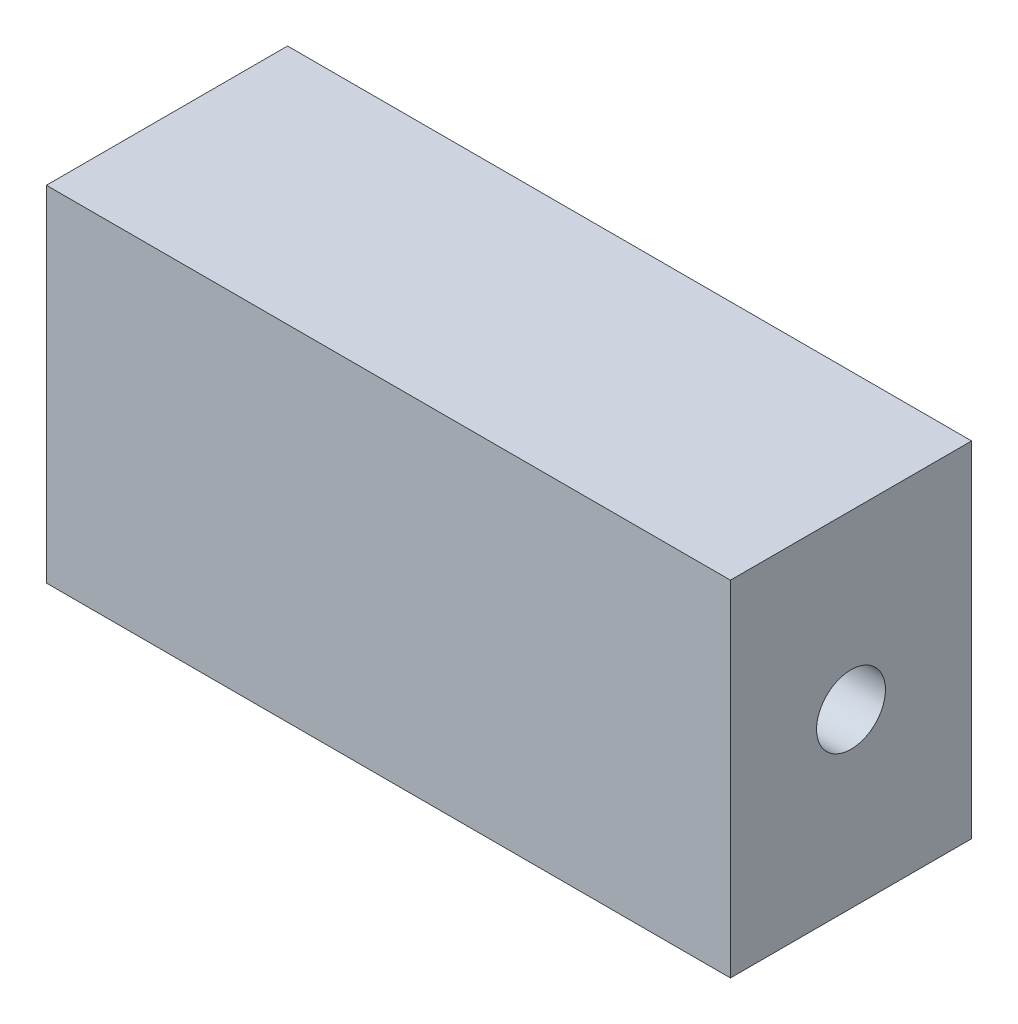
ISO-10303-21;
HEADER;
FILE_DESCRIPTION(('STEP AP214'),'2;1');
FILE_NAME('part.step','',(''),(''),'','','');
FILE_SCHEMA(('AUTOMOTIVE_DESIGN { 1 0 10303 214 1 1 1 1 }'));
ENDSEC;
DATA;
#1=APPLICATION_CONTEXT('core data for automotive mechanical design processes');
#2=APPLICATION_PROTOCOL_DEFINITION('international standard','automotive_design',2000,#1);
#3=PRODUCT_CONTEXT('',#1,'mechanical');
#4=PRODUCT('Part','Part','',(#3));
#5=PRODUCT_RELATED_PRODUCT_CATEGORY('part','',(#4));
#6=PRODUCT_DEFINITION_FORMATION('','',#4);
#7=PRODUCT_DEFINITION_CONTEXT('part definition',#1,'design');
#8=PRODUCT_DEFINITION('design','',#6,#7);
#9=PRODUCT_DEFINITION_SHAPE('','',#8);
#10=(LENGTH_UNIT() NAMED_UNIT(*) SI_UNIT(.MILLI.,.METRE.));
#11=(NAMED_UNIT(*) PLANE_ANGLE_UNIT() SI_UNIT($,.RADIAN.));
#12=(NAMED_UNIT(*) SI_UNIT($,.STERADIAN.) SOLID_ANGLE_UNIT());
#13=UNCERTAINTY_MEASURE_WITH_UNIT(LENGTH_MEASURE(1.E-05),#10,'distance_accuracy_value','');
#14=(GEOMETRIC_REPRESENTATION_CONTEXT(3) GLOBAL_UNCERTAINTY_ASSIGNED_CONTEXT((#13)) GLOBAL_UNIT_ASSIGNED_CONTEXT((#10,
#11,#12)) REPRESENTATION_CONTEXT('',''));
#15=CARTESIAN_POINT('',(0.,0.,0.));
#16=DIRECTION('',(0.,0.,1.));
#17=DIRECTION('',(1.,0.,0.));
#18=AXIS2_PLACEMENT_3D('',#15,#16,#17);
#19=CARTESIAN_POINT('',(49.6350164820129,50.,17.5));
#20=DIRECTION('',(-1.,0.,0.));
#21=DIRECTION('',(0.,0.,1.));
#22=AXIS2_PLACEMENT_3D('',#19,#20,#21);
#23=PLANE('',#22);
#24=CARTESIAN_POINT('',(49.6350164820129,25.,0.));
#25=DIRECTION('',(1.,0.,0.));
#26=DIRECTION('',(0.,0.,-1.));
#27=AXIS2_PLACEMENT_3D('',#24,#25,#26);
#28=CIRCLE('',#27,5.);
#29=CARTESIAN_POINT('',(49.6350164820129,25.,-4.99999999999999));
#30=VERTEX_POINT('',#29);
#31=EDGE_CURVE('E116',#30,#30,#28,.T.);
#32=ORIENTED_EDGE('',*,*,#31,.F.);
#33=EDGE_LOOP('',(#32));
#34=FACE_BOUND('',#33,.T.);
#35=DIRECTION('',(0.,0.,-1.));
#36=VECTOR('',#35,1.);
#37=CARTESIAN_POINT('',(49.6350164820129,0.,17.5));
#38=LINE('',#37,#36);
#39=CARTESIAN_POINT('',(49.6350164820129,0.,17.5));
#40=VERTEX_POINT('',#39);
#41=CARTESIAN_POINT('',(49.6350164820129,0.,-17.5));
#42=VERTEX_POINT('',#41);
#43=EDGE_CURVE('E96',#40,#42,#38,.T.);
#44=ORIENTED_EDGE('',*,*,#43,.T.);
#45=DIRECTION('',(0.,-1.,0.));
#46=VECTOR('',#45,1.);
#47=CARTESIAN_POINT('',(49.6350164820129,50.,-17.5));
#48=LINE('',#47,#46);
#49=CARTESIAN_POINT('',(49.6350164820129,50.,-17.5));
#50=VERTEX_POINT('',#49);
#51=EDGE_CURVE('E11',#50,#42,#48,.T.);
#52=ORIENTED_EDGE('',*,*,#51,.F.);
#53=DIRECTION('',(0.,0.,-1.));
#54=VECTOR('',#53,1.);
#55=CARTESIAN_POINT('',(49.6350164820129,50.,17.5));
#56=LINE('',#55,#54);
#57=CARTESIAN_POINT('',(49.6350164820129,50.,17.5));
#58=VERTEX_POINT('',#57);
#59=EDGE_CURVE('E84',#58,#50,#56,.T.);
#60=ORIENTED_EDGE('',*,*,#59,.F.);
#61=DIRECTION('',(0.,-1.,0.));
#62=VECTOR('',#61,1.);
#63=CARTESIAN_POINT('',(49.6350164820129,50.,17.5));
#64=LINE('',#63,#62);
#65=EDGE_CURVE('E92',#58,#40,#64,.T.);
#66=ORIENTED_EDGE('',*,*,#65,.T.);
#67=EDGE_LOOP('',(#44,#52,#60,#66));
#68=FACE_BOUND('',#67,.T.);
#69=ADVANCED_FACE('F33',(#34,#68),#23,.F.);
#70=CARTESIAN_POINT('',(-49.6350164820129,50.,-17.5));
#71=DIRECTION('',(0.,0.,1.));
#72=DIRECTION('',(1.,0.,0.));
#73=AXIS2_PLACEMENT_3D('',#70,#71,#72);
#74=PLANE('',#73);
#75=DIRECTION('',(-1.,0.,0.));
#76=VECTOR('',#75,1.);
#77=CARTESIAN_POINT('',(-49.6350164820129,0.,-17.5));
#78=LINE('',#77,#76);
#79=CARTESIAN_POINT('',(-49.6350164820129,0.,-17.5));
#80=VERTEX_POINT('',#79);
#81=EDGE_CURVE('E88',#42,#80,#78,.T.);
#82=ORIENTED_EDGE('',*,*,#81,.T.);
#83=DIRECTION('',(0.,-1.,0.));
#84=VECTOR('',#83,1.);
#85=CARTESIAN_POINT('',(-49.6350164820129,50.,-17.5));
#86=LINE('',#85,#84);
#87=CARTESIAN_POINT('',(-49.6350164820129,50.,-17.5));
#88=VERTEX_POINT('',#87);
#89=EDGE_CURVE('E41',#88,#80,#86,.T.);
#90=ORIENTED_EDGE('',*,*,#89,.F.);
#91=DIRECTION('',(-1.,0.,0.));
#92=VECTOR('',#91,1.);
#93=CARTESIAN_POINT('',(-49.6350164820129,50.,-17.5));
#94=LINE('',#93,#92);
#95=EDGE_CURVE('E79',#50,#88,#94,.T.);
#96=ORIENTED_EDGE('',*,*,#95,.F.);
#97=ORIENTED_EDGE('',*,*,#51,.T.);
#98=EDGE_LOOP('',(#82,#90,#96,#97));
#99=FACE_BOUND('',#98,.T.);
#100=ADVANCED_FACE('F87',(#99),#74,.F.);
#101=CARTESIAN_POINT('',(-49.6350164820129,50.,17.5));
#102=DIRECTION('',(1.,0.,0.));
#103=DIRECTION('',(0.,0.,-1.));
#104=AXIS2_PLACEMENT_3D('',#101,#102,#103);
#105=PLANE('',#104);
#106=CARTESIAN_POINT('',(-49.6350164820129,25.,0.));
#107=DIRECTION('',(-1.,0.,0.));
#108=DIRECTION('',(0.,0.,1.));
#109=AXIS2_PLACEMENT_3D('',#106,#107,#108);
#110=CIRCLE('',#109,5.);
#111=CARTESIAN_POINT('',(-49.6350164820129,25.,4.99999999999997));
#112=VERTEX_POINT('',#111);
#113=EDGE_CURVE('E110',#112,#112,#110,.T.);
#114=ORIENTED_EDGE('',*,*,#113,.F.);
#115=EDGE_LOOP('',(#114));
#116=FACE_BOUND('',#115,.T.);
#117=DIRECTION('',(0.,0.,1.));
#118=VECTOR('',#117,1.);
#119=CARTESIAN_POINT('',(-49.6350164820129,0.,17.5));
#120=LINE('',#119,#118);
#121=CARTESIAN_POINT('',(-49.6350164820129,0.,17.5));
#122=VERTEX_POINT('',#121);
#123=EDGE_CURVE('E66',#80,#122,#120,.T.);
#124=ORIENTED_EDGE('',*,*,#123,.T.);
#125=DIRECTION('',(0.,-1.,0.));
#126=VECTOR('',#125,1.);
#127=CARTESIAN_POINT('',(-49.6350164820129,50.,17.5));
#128=LINE('',#127,#126);
#129=CARTESIAN_POINT('',(-49.6350164820129,50.,17.5));
#130=VERTEX_POINT('',#129);
#131=EDGE_CURVE('E89',#130,#122,#128,.T.);
#132=ORIENTED_EDGE('',*,*,#131,.F.);
#133=DIRECTION('',(0.,0.,1.));
#134=VECTOR('',#133,1.);
#135=CARTESIAN_POINT('',(-49.6350164820129,50.,17.5));
#136=LINE('',#135,#134);
#137=EDGE_CURVE('E82',#88,#130,#136,.T.);
#138=ORIENTED_EDGE('',*,*,#137,.F.);
#139=ORIENTED_EDGE('',*,*,#89,.T.);
#140=EDGE_LOOP('',(#124,#132,#138,#139));
#141=FACE_BOUND('',#140,.T.);
#142=ADVANCED_FACE('F90',(#116,#141),#105,.F.);
#143=CARTESIAN_POINT('',(-49.6350164820129,50.,17.5));
#144=DIRECTION('',(0.,0.,-1.));
#145=DIRECTION('',(-1.,0.,0.));
#146=AXIS2_PLACEMENT_3D('',#143,#144,#145);
#147=PLANE('',#146);
#148=DIRECTION('',(1.,0.,0.));
#149=VECTOR('',#148,1.);
#150=CARTESIAN_POINT('',(-49.6350164820129,0.,17.5));
#151=LINE('',#150,#149);
#152=EDGE_CURVE('E72',#122,#40,#151,.T.);
#153=ORIENTED_EDGE('',*,*,#152,.T.);
#154=ORIENTED_EDGE('',*,*,#65,.F.);
#155=DIRECTION('',(1.,0.,0.));
#156=VECTOR('',#155,1.);
#157=CARTESIAN_POINT('',(-49.6350164820129,50.,17.5));
#158=LINE('',#157,#156);
#159=EDGE_CURVE('E49',#130,#58,#158,.T.);
#160=ORIENTED_EDGE('',*,*,#159,.F.);
#161=ORIENTED_EDGE('',*,*,#131,.T.);
#162=EDGE_LOOP('',(#153,#154,#160,#161));
#163=FACE_BOUND('',#162,.T.);
#164=ADVANCED_FACE('F104',(#163),#147,.F.);
#165=CARTESIAN_POINT('',(0.,50.,0.));
#166=DIRECTION('',(0.,-1.,0.));
#167=DIRECTION('',(0.,0.,-1.));
#168=AXIS2_PLACEMENT_3D('',#165,#166,#167);
#169=PLANE('',#168);
#170=ORIENTED_EDGE('',*,*,#59,.T.);
#171=ORIENTED_EDGE('',*,*,#95,.T.);
#172=ORIENTED_EDGE('',*,*,#137,.T.);
#173=ORIENTED_EDGE('',*,*,#159,.T.);
#174=EDGE_LOOP('',(#170,#171,#172,#173));
#175=FACE_BOUND('',#174,.T.);
#176=ADVANCED_FACE('F80',(#175),#169,.F.);
#177=CARTESIAN_POINT('',(0.,0.,0.));
#178=DIRECTION('',(0.,-1.,0.));
#179=DIRECTION('',(0.,0.,-1.));
#180=AXIS2_PLACEMENT_3D('',#177,#178,#179);
#181=PLANE('',#180);
#182=ORIENTED_EDGE('',*,*,#43,.F.);
#183=ORIENTED_EDGE('',*,*,#152,.F.);
#184=ORIENTED_EDGE('',*,*,#123,.F.);
#185=ORIENTED_EDGE('',*,*,#81,.F.);
#186=EDGE_LOOP('',(#182,#183,#184,#185));
#187=FACE_BOUND('',#186,.T.);
#188=ADVANCED_FACE('F107',(#187),#181,.T.);
#189=CARTESIAN_POINT('',(-39.6350164820129,25.,0.));
#190=DIRECTION('',(-1.,0.,0.));
#191=DIRECTION('',(0.,0.,1.));
#192=AXIS2_PLACEMENT_3D('',#189,#190,#191);
#193=CYLINDRICAL_SURFACE('',#192,5.);
#194=CARTESIAN_POINT('',(-39.6350164820129,25.,0.));
#195=DIRECTION('',(-1.,0.,0.));
#196=DIRECTION('',(0.,0.,1.));
#197=AXIS2_PLACEMENT_3D('',#194,#195,#196);
#198=CIRCLE('',#197,5.);
#199=CARTESIAN_POINT('',(-39.6350164820129,25.,4.99999999999997));
#200=VERTEX_POINT('',#199);
#201=EDGE_CURVE('E99',#200,#200,#198,.T.);
#202=ORIENTED_EDGE('',*,*,#201,.F.);
#203=EDGE_LOOP('',(#202));
#204=FACE_BOUND('',#203,.T.);
#205=ORIENTED_EDGE('',*,*,#113,.T.);
#206=EDGE_LOOP('',(#205));
#207=FACE_BOUND('',#206,.T.);
#208=ADVANCED_FACE('F145',(#204,#207),#193,.F.);
#209=CARTESIAN_POINT('',(-39.6350164820129,25.,0.));
#210=DIRECTION('',(-1.,0.,0.));
#211=DIRECTION('',(0.,0.,1.));
#212=AXIS2_PLACEMENT_3D('',#209,#210,#211);
#213=PLANE('',#212);
#214=ORIENTED_EDGE('',*,*,#201,.T.);
#215=EDGE_LOOP('',(#214));
#216=FACE_BOUND('',#215,.T.);
#217=ADVANCED_FACE('F127',(#216),#213,.T.);
#218=CARTESIAN_POINT('',(39.6350164820129,25.,0.));
#219=DIRECTION('',(1.,0.,0.));
#220=DIRECTION('',(0.,0.,-1.));
#221=AXIS2_PLACEMENT_3D('',#218,#219,#220);
#222=CYLINDRICAL_SURFACE('',#221,5.);
#223=CARTESIAN_POINT('',(39.6350164820129,25.,0.));
#224=DIRECTION('',(1.,0.,0.));
#225=DIRECTION('',(0.,0.,-1.));
#226=AXIS2_PLACEMENT_3D('',#223,#224,#225);
#227=CIRCLE('',#226,5.);
#228=CARTESIAN_POINT('',(39.6350164820129,25.,-4.99999999999999));
#229=VERTEX_POINT('',#228);
#230=EDGE_CURVE('E113',#229,#229,#227,.T.);
#231=ORIENTED_EDGE('',*,*,#230,.F.);
#232=EDGE_LOOP('',(#231));
#233=FACE_BOUND('',#232,.T.);
#234=ORIENTED_EDGE('',*,*,#31,.T.);
#235=EDGE_LOOP('',(#234));
#236=FACE_BOUND('',#235,.T.);
#237=ADVANCED_FACE('F124',(#233,#236),#222,.F.);
#238=CARTESIAN_POINT('',(39.6350164820129,25.,0.));
#239=DIRECTION('',(1.,0.,0.));
#240=DIRECTION('',(0.,0.,-1.));
#241=AXIS2_PLACEMENT_3D('',#238,#239,#240);
#242=PLANE('',#241);
#243=ORIENTED_EDGE('',*,*,#230,.T.);
#244=EDGE_LOOP('',(#243));
#245=FACE_BOUND('',#244,.T.);
#246=ADVANCED_FACE('F122',(#245),#242,.T.);
#247=CLOSED_SHELL('',(#69,#100,#142,#164,#176,#188,#208,#217,#237,#246));
#248=MANIFOLD_SOLID_BREP('B2',#247);
#249=ADVANCED_BREP_SHAPE_REPRESENTATION('',(#18,#248),#14);
#250=SHAPE_DEFINITION_REPRESENTATION(#9,#249);
ENDSEC;
END-ISO-10303-21;
